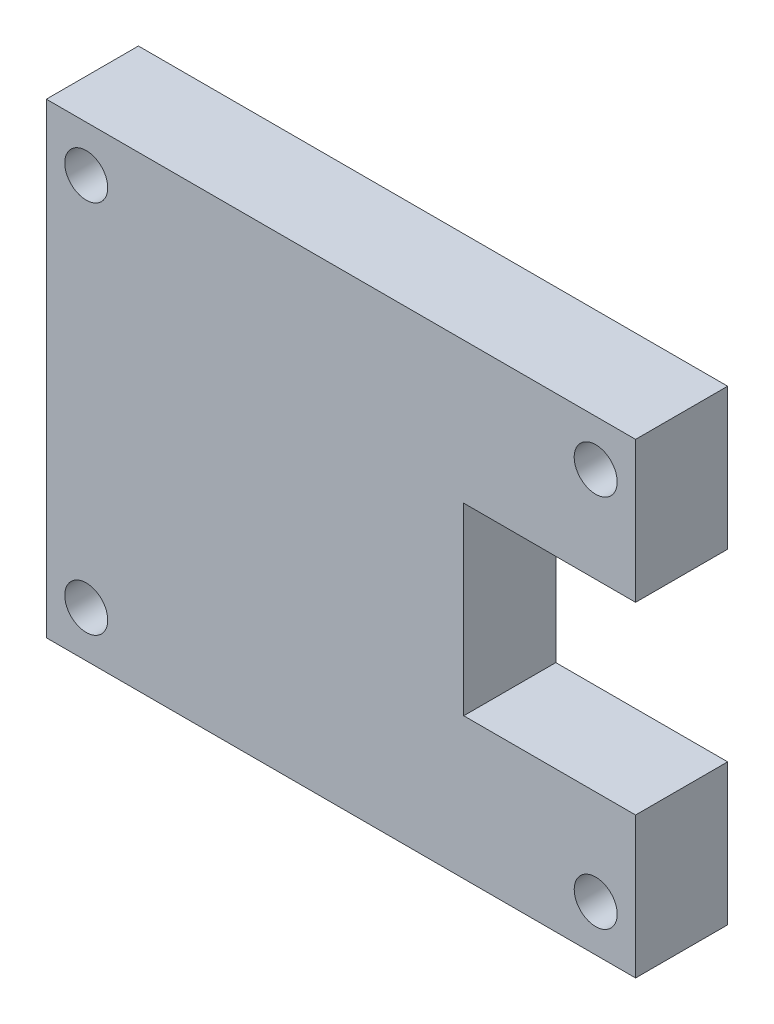
ISO-10303-21;
HEADER;
FILE_DESCRIPTION(('STEP AP214'),'2;1');
FILE_NAME('part.step','',(''),(''),'','','');
FILE_SCHEMA(('AUTOMOTIVE_DESIGN { 1 0 10303 214 1 1 1 1 }'));
ENDSEC;
DATA;
#1=APPLICATION_CONTEXT('core data for automotive mechanical design processes');
#2=APPLICATION_PROTOCOL_DEFINITION('international standard','automotive_design',2000,#1);
#3=PRODUCT_CONTEXT('',#1,'mechanical');
#4=PRODUCT('Part','Part','',(#3));
#5=PRODUCT_RELATED_PRODUCT_CATEGORY('part','',(#4));
#6=PRODUCT_DEFINITION_FORMATION('','',#4);
#7=PRODUCT_DEFINITION_CONTEXT('part definition',#1,'design');
#8=PRODUCT_DEFINITION('design','',#6,#7);
#9=PRODUCT_DEFINITION_SHAPE('','',#8);
#10=(LENGTH_UNIT() NAMED_UNIT(*) SI_UNIT(.MILLI.,.METRE.));
#11=(NAMED_UNIT(*) PLANE_ANGLE_UNIT() SI_UNIT($,.RADIAN.));
#12=(NAMED_UNIT(*) SI_UNIT($,.STERADIAN.) SOLID_ANGLE_UNIT());
#13=UNCERTAINTY_MEASURE_WITH_UNIT(LENGTH_MEASURE(1.E-05),#10,'distance_accuracy_value','');
#14=(GEOMETRIC_REPRESENTATION_CONTEXT(3) GLOBAL_UNCERTAINTY_ASSIGNED_CONTEXT((#13)) GLOBAL_UNIT_ASSIGNED_CONTEXT((#10,
#11,#12)) REPRESENTATION_CONTEXT('',''));
#15=CARTESIAN_POINT('',(0.,0.,0.));
#16=DIRECTION('',(0.,0.,1.));
#17=DIRECTION('',(1.,0.,0.));
#18=AXIS2_PLACEMENT_3D('',#15,#16,#17);
#19=CARTESIAN_POINT('',(24.,-19.,7.5));
#20=DIRECTION('',(-1.,0.,0.));
#21=DIRECTION('',(0.,0.,1.));
#22=AXIS2_PLACEMENT_3D('',#19,#20,#21);
#23=PLANE('',#22);
#24=DIRECTION('',(0.,1.,0.));
#25=VECTOR('',#24,1.);
#26=CARTESIAN_POINT('',(24.,-19.,7.5));
#27=LINE('',#26,#25);
#28=CARTESIAN_POINT('',(24.,7.5,7.5));
#29=VERTEX_POINT('',#28);
#30=CARTESIAN_POINT('',(24.,19.,7.5));
#31=VERTEX_POINT('',#30);
#32=EDGE_CURVE('E85',#29,#31,#27,.T.);
#33=ORIENTED_EDGE('',*,*,#32,.F.);
#34=DIRECTION('',(0.,0.,1.));
#35=VECTOR('',#34,1.);
#36=CARTESIAN_POINT('',(24.,7.5,0.));
#37=LINE('',#36,#35);
#38=CARTESIAN_POINT('',(24.,7.5,0.));
#39=VERTEX_POINT('',#38);
#40=EDGE_CURVE('E140',#39,#29,#37,.T.);
#41=ORIENTED_EDGE('',*,*,#40,.F.);
#42=DIRECTION('',(0.,1.,0.));
#43=VECTOR('',#42,1.);
#44=CARTESIAN_POINT('',(24.,-19.,0.));
#45=LINE('',#44,#43);
#46=CARTESIAN_POINT('',(24.,19.,0.));
#47=VERTEX_POINT('',#46);
#48=EDGE_CURVE('E164',#39,#47,#45,.T.);
#49=ORIENTED_EDGE('',*,*,#48,.T.);
#50=DIRECTION('',(0.,0.,-1.));
#51=VECTOR('',#50,1.);
#52=CARTESIAN_POINT('',(24.,19.,7.5));
#53=LINE('',#52,#51);
#54=EDGE_CURVE('E11',#31,#47,#53,.T.);
#55=ORIENTED_EDGE('',*,*,#54,.F.);
#56=EDGE_LOOP('',(#33,#41,#49,#55));
#57=FACE_BOUND('',#56,.T.);
#58=ADVANCED_FACE('F33',(#57),#23,.F.);
#59=CARTESIAN_POINT('',(24.,-19.,0.));
#60=VERTEX_POINT('',#59);
#61=CARTESIAN_POINT('',(24.,-7.5,0.));
#62=VERTEX_POINT('',#61);
#63=EDGE_CURVE('E175',#60,#62,#45,.T.);
#64=ORIENTED_EDGE('',*,*,#63,.T.);
#65=DIRECTION('',(0.,0.,1.));
#66=VECTOR('',#65,1.);
#67=CARTESIAN_POINT('',(24.,-7.5,0.));
#68=LINE('',#67,#66);
#69=CARTESIAN_POINT('',(24.,-7.5,7.5));
#70=VERTEX_POINT('',#69);
#71=EDGE_CURVE('E48',#62,#70,#68,.T.);
#72=ORIENTED_EDGE('',*,*,#71,.T.);
#73=CARTESIAN_POINT('',(24.,-19.,7.5));
#74=VERTEX_POINT('',#73);
#75=EDGE_CURVE('E167',#74,#70,#27,.T.);
#76=ORIENTED_EDGE('',*,*,#75,.F.);
#77=DIRECTION('',(0.,0.,-1.));
#78=VECTOR('',#77,1.);
#79=CARTESIAN_POINT('',(24.,-19.,7.5));
#80=LINE('',#79,#78);
#81=EDGE_CURVE('E174',#74,#60,#80,.T.);
#82=ORIENTED_EDGE('',*,*,#81,.T.);
#83=EDGE_LOOP('',(#64,#72,#76,#82));
#84=FACE_BOUND('',#83,.T.);
#85=ADVANCED_FACE('F35',(#84),#23,.F.);
#86=CARTESIAN_POINT('',(-24.,19.,7.5));
#87=DIRECTION('',(0.,-1.,0.));
#88=DIRECTION('',(0.,0.,-1.));
#89=AXIS2_PLACEMENT_3D('',#86,#87,#88);
#90=PLANE('',#89);
#91=DIRECTION('',(-1.,0.,0.));
#92=VECTOR('',#91,1.);
#93=CARTESIAN_POINT('',(-24.,19.,0.));
#94=LINE('',#93,#92);
#95=CARTESIAN_POINT('',(-24.,19.,0.));
#96=VERTEX_POINT('',#95);
#97=EDGE_CURVE('E177',#47,#96,#94,.T.);
#98=ORIENTED_EDGE('',*,*,#97,.T.);
#99=DIRECTION('',(0.,0.,-1.));
#100=VECTOR('',#99,1.);
#101=CARTESIAN_POINT('',(-24.,19.,7.5));
#102=LINE('',#101,#100);
#103=CARTESIAN_POINT('',(-24.,19.,7.5));
#104=VERTEX_POINT('',#103);
#105=EDGE_CURVE('E41',#104,#96,#102,.T.);
#106=ORIENTED_EDGE('',*,*,#105,.F.);
#107=DIRECTION('',(-1.,0.,0.));
#108=VECTOR('',#107,1.);
#109=CARTESIAN_POINT('',(-24.,19.,7.5));
#110=LINE('',#109,#108);
#111=EDGE_CURVE('E169',#31,#104,#110,.T.);
#112=ORIENTED_EDGE('',*,*,#111,.F.);
#113=ORIENTED_EDGE('',*,*,#54,.T.);
#114=EDGE_LOOP('',(#98,#106,#112,#113));
#115=FACE_BOUND('',#114,.T.);
#116=ADVANCED_FACE('F206',(#115),#90,.F.);
#117=CARTESIAN_POINT('',(-24.,-19.,7.5));
#118=DIRECTION('',(1.,0.,0.));
#119=DIRECTION('',(0.,0.,-1.));
#120=AXIS2_PLACEMENT_3D('',#117,#118,#119);
#121=PLANE('',#120);
#122=DIRECTION('',(0.,-1.,0.));
#123=VECTOR('',#122,1.);
#124=CARTESIAN_POINT('',(-24.,-19.,0.));
#125=LINE('',#124,#123);
#126=CARTESIAN_POINT('',(-24.,-19.,0.));
#127=VERTEX_POINT('',#126);
#128=EDGE_CURVE('E179',#96,#127,#125,.T.);
#129=ORIENTED_EDGE('',*,*,#128,.T.);
#130=DIRECTION('',(0.,0.,-1.));
#131=VECTOR('',#130,1.);
#132=CARTESIAN_POINT('',(-24.,-19.,7.5));
#133=LINE('',#132,#131);
#134=CARTESIAN_POINT('',(-24.,-19.,7.5));
#135=VERTEX_POINT('',#134);
#136=EDGE_CURVE('E183',#135,#127,#133,.T.);
#137=ORIENTED_EDGE('',*,*,#136,.F.);
#138=DIRECTION('',(0.,-1.,0.));
#139=VECTOR('',#138,1.);
#140=CARTESIAN_POINT('',(-24.,-19.,7.5));
#141=LINE('',#140,#139);
#142=EDGE_CURVE('E171',#104,#135,#141,.T.);
#143=ORIENTED_EDGE('',*,*,#142,.F.);
#144=ORIENTED_EDGE('',*,*,#105,.T.);
#145=EDGE_LOOP('',(#129,#137,#143,#144));
#146=FACE_BOUND('',#145,.T.);
#147=ADVANCED_FACE('F189',(#146),#121,.F.);
#148=CARTESIAN_POINT('',(-24.,-19.,7.5));
#149=DIRECTION('',(0.,1.,0.));
#150=DIRECTION('',(0.,0.,1.));
#151=AXIS2_PLACEMENT_3D('',#148,#149,#150);
#152=PLANE('',#151);
#153=DIRECTION('',(1.,0.,0.));
#154=VECTOR('',#153,1.);
#155=CARTESIAN_POINT('',(-24.,-19.,0.));
#156=LINE('',#155,#154);
#157=EDGE_CURVE('E78',#127,#60,#156,.T.);
#158=ORIENTED_EDGE('',*,*,#157,.T.);
#159=ORIENTED_EDGE('',*,*,#81,.F.);
#160=DIRECTION('',(1.,0.,0.));
#161=VECTOR('',#160,1.);
#162=CARTESIAN_POINT('',(-24.,-19.,7.5));
#163=LINE('',#162,#161);
#164=EDGE_CURVE('E57',#135,#74,#163,.T.);
#165=ORIENTED_EDGE('',*,*,#164,.F.);
#166=ORIENTED_EDGE('',*,*,#136,.T.);
#167=EDGE_LOOP('',(#158,#159,#165,#166));
#168=FACE_BOUND('',#167,.T.);
#169=ADVANCED_FACE('F195',(#168),#152,.F.);
#170=CARTESIAN_POINT('',(0.,0.,7.5));
#171=DIRECTION('',(0.,0.,-1.));
#172=DIRECTION('',(-1.,0.,0.));
#173=AXIS2_PLACEMENT_3D('',#170,#171,#172);
#174=PLANE('',#173);
#175=CARTESIAN_POINT('',(-20.75,15.25,7.5));
#176=DIRECTION('',(0.,0.,1.));
#177=DIRECTION('',(-1.,0.,0.));
#178=AXIS2_PLACEMENT_3D('',#175,#176,#177);
#179=CIRCLE('',#178,1.75);
#180=CARTESIAN_POINT('',(-22.5,15.25,7.5));
#181=VERTEX_POINT('',#180);
#182=EDGE_CURVE('E153',#181,#181,#179,.T.);
#183=ORIENTED_EDGE('',*,*,#182,.F.);
#184=EDGE_LOOP('',(#183));
#185=FACE_BOUND('',#184,.T.);
#186=CARTESIAN_POINT('',(20.75,-15.25,7.5));
#187=DIRECTION('',(0.,0.,1.));
#188=DIRECTION('',(-1.,0.,0.));
#189=AXIS2_PLACEMENT_3D('',#186,#187,#188);
#190=CIRCLE('',#189,1.75);
#191=CARTESIAN_POINT('',(19.,-15.25,7.5));
#192=VERTEX_POINT('',#191);
#193=EDGE_CURVE('E146',#192,#192,#190,.T.);
#194=ORIENTED_EDGE('',*,*,#193,.F.);
#195=EDGE_LOOP('',(#194));
#196=FACE_BOUND('',#195,.T.);
#197=CARTESIAN_POINT('',(-20.75,-15.25,7.5));
#198=DIRECTION('',(0.,0.,1.));
#199=DIRECTION('',(1.,0.,0.));
#200=AXIS2_PLACEMENT_3D('',#197,#198,#199);
#201=CIRCLE('',#200,1.75);
#202=CARTESIAN_POINT('',(-19.,-15.25,7.5));
#203=VERTEX_POINT('',#202);
#204=EDGE_CURVE('E139',#203,#203,#201,.T.);
#205=ORIENTED_EDGE('',*,*,#204,.F.);
#206=EDGE_LOOP('',(#205));
#207=FACE_BOUND('',#206,.T.);
#208=CARTESIAN_POINT('',(20.75,15.25,7.5));
#209=DIRECTION('',(0.,0.,1.));
#210=DIRECTION('',(1.,0.,0.));
#211=AXIS2_PLACEMENT_3D('',#208,#209,#210);
#212=CIRCLE('',#211,1.75);
#213=CARTESIAN_POINT('',(22.5,15.25,7.5));
#214=VERTEX_POINT('',#213);
#215=EDGE_CURVE('E152',#214,#214,#212,.T.);
#216=ORIENTED_EDGE('',*,*,#215,.F.);
#217=EDGE_LOOP('',(#216));
#218=FACE_BOUND('',#217,.T.);
#219=DIRECTION('',(0.,-1.,0.));
#220=VECTOR('',#219,1.);
#221=CARTESIAN_POINT('',(10.,0.,7.5));
#222=LINE('',#221,#220);
#223=CARTESIAN_POINT('',(10.,7.5,7.5));
#224=VERTEX_POINT('',#223);
#225=CARTESIAN_POINT('',(10.,-7.5,7.5));
#226=VERTEX_POINT('',#225);
#227=EDGE_CURVE('E115',#224,#226,#222,.T.);
#228=ORIENTED_EDGE('',*,*,#227,.F.);
#229=DIRECTION('',(-1.,0.,0.));
#230=VECTOR('',#229,1.);
#231=CARTESIAN_POINT('',(0.,7.5,7.5));
#232=LINE('',#231,#230);
#233=EDGE_CURVE('E128',#29,#224,#232,.T.);
#234=ORIENTED_EDGE('',*,*,#233,.F.);
#235=ORIENTED_EDGE('',*,*,#32,.T.);
#236=ORIENTED_EDGE('',*,*,#111,.T.);
#237=ORIENTED_EDGE('',*,*,#142,.T.);
#238=ORIENTED_EDGE('',*,*,#164,.T.);
#239=ORIENTED_EDGE('',*,*,#75,.T.);
#240=DIRECTION('',(1.,0.,0.));
#241=VECTOR('',#240,1.);
#242=CARTESIAN_POINT('',(0.,-7.5,7.5));
#243=LINE('',#242,#241);
#244=EDGE_CURVE('E131',#226,#70,#243,.T.);
#245=ORIENTED_EDGE('',*,*,#244,.F.);
#246=EDGE_LOOP('',(#228,#234,#235,#236,#237,#238,#239,#245));
#247=FACE_BOUND('',#246,.T.);
#248=ADVANCED_FACE('F197',(#185,#196,#207,#218,#247),#174,.F.);
#249=CARTESIAN_POINT('',(0.,0.,0.));
#250=DIRECTION('',(0.,0.,-1.));
#251=DIRECTION('',(-1.,0.,0.));
#252=AXIS2_PLACEMENT_3D('',#249,#250,#251);
#253=PLANE('',#252);
#254=DIRECTION('',(-1.,0.,0.));
#255=VECTOR('',#254,1.);
#256=CARTESIAN_POINT('',(0.,7.5,0.));
#257=LINE('',#256,#255);
#258=CARTESIAN_POINT('',(10.,7.5,0.));
#259=VERTEX_POINT('',#258);
#260=EDGE_CURVE('E117',#39,#259,#257,.T.);
#261=ORIENTED_EDGE('',*,*,#260,.T.);
#262=DIRECTION('',(0.,-1.,0.));
#263=VECTOR('',#262,1.);
#264=CARTESIAN_POINT('',(10.,0.,0.));
#265=LINE('',#264,#263);
#266=CARTESIAN_POINT('',(10.,-7.5,0.));
#267=VERTEX_POINT('',#266);
#268=EDGE_CURVE('E112',#259,#267,#265,.T.);
#269=ORIENTED_EDGE('',*,*,#268,.T.);
#270=DIRECTION('',(1.,0.,0.));
#271=VECTOR('',#270,1.);
#272=CARTESIAN_POINT('',(0.,-7.5,0.));
#273=LINE('',#272,#271);
#274=EDGE_CURVE('E119',#267,#62,#273,.T.);
#275=ORIENTED_EDGE('',*,*,#274,.T.);
#276=ORIENTED_EDGE('',*,*,#63,.F.);
#277=ORIENTED_EDGE('',*,*,#157,.F.);
#278=ORIENTED_EDGE('',*,*,#128,.F.);
#279=ORIENTED_EDGE('',*,*,#97,.F.);
#280=ORIENTED_EDGE('',*,*,#48,.F.);
#281=EDGE_LOOP('',(#261,#269,#275,#276,#277,#278,#279,#280));
#282=FACE_BOUND('',#281,.T.);
#283=CARTESIAN_POINT('',(-20.75,15.25,0.));
#284=DIRECTION('',(0.,0.,1.));
#285=DIRECTION('',(-1.,0.,0.));
#286=AXIS2_PLACEMENT_3D('',#283,#284,#285);
#287=CIRCLE('',#286,1.75);
#288=CARTESIAN_POINT('',(-22.5,15.25,0.));
#289=VERTEX_POINT('',#288);
#290=EDGE_CURVE('E149',#289,#289,#287,.T.);
#291=ORIENTED_EDGE('',*,*,#290,.T.);
#292=EDGE_LOOP('',(#291));
#293=FACE_BOUND('',#292,.T.);
#294=CARTESIAN_POINT('',(20.75,-15.25,0.));
#295=DIRECTION('',(0.,0.,1.));
#296=DIRECTION('',(-1.,0.,0.));
#297=AXIS2_PLACEMENT_3D('',#294,#295,#296);
#298=CIRCLE('',#297,1.75);
#299=CARTESIAN_POINT('',(19.,-15.25,0.));
#300=VERTEX_POINT('',#299);
#301=EDGE_CURVE('E156',#300,#300,#298,.T.);
#302=ORIENTED_EDGE('',*,*,#301,.T.);
#303=EDGE_LOOP('',(#302));
#304=FACE_BOUND('',#303,.T.);
#305=CARTESIAN_POINT('',(-20.75,-15.25,0.));
#306=DIRECTION('',(0.,0.,1.));
#307=DIRECTION('',(1.,0.,0.));
#308=AXIS2_PLACEMENT_3D('',#305,#306,#307);
#309=CIRCLE('',#308,1.75);
#310=CARTESIAN_POINT('',(-19.,-15.25,0.));
#311=VERTEX_POINT('',#310);
#312=EDGE_CURVE('E143',#311,#311,#309,.T.);
#313=ORIENTED_EDGE('',*,*,#312,.T.);
#314=EDGE_LOOP('',(#313));
#315=FACE_BOUND('',#314,.T.);
#316=CARTESIAN_POINT('',(20.75,15.25,0.));
#317=DIRECTION('',(0.,0.,1.));
#318=DIRECTION('',(1.,0.,0.));
#319=AXIS2_PLACEMENT_3D('',#316,#317,#318);
#320=CIRCLE('',#319,1.75);
#321=CARTESIAN_POINT('',(22.5,15.25,0.));
#322=VERTEX_POINT('',#321);
#323=EDGE_CURVE('E161',#322,#322,#320,.T.);
#324=ORIENTED_EDGE('',*,*,#323,.T.);
#325=EDGE_LOOP('',(#324));
#326=FACE_BOUND('',#325,.T.);
#327=ADVANCED_FACE('F125',(#282,#293,#304,#315,#326),#253,.T.);
#328=CARTESIAN_POINT('',(20.75,15.25,0.));
#329=DIRECTION('',(0.,0.,1.));
#330=DIRECTION('',(1.,0.,0.));
#331=AXIS2_PLACEMENT_3D('',#328,#329,#330);
#332=CYLINDRICAL_SURFACE('',#331,1.75);
#333=ORIENTED_EDGE('',*,*,#323,.F.);
#334=EDGE_LOOP('',(#333));
#335=FACE_BOUND('',#334,.T.);
#336=ORIENTED_EDGE('',*,*,#215,.T.);
#337=EDGE_LOOP('',(#336));
#338=FACE_BOUND('',#337,.T.);
#339=ADVANCED_FACE('F233',(#335,#338),#332,.F.);
#340=CARTESIAN_POINT('',(-20.75,-15.25,0.));
#341=DIRECTION('',(0.,0.,1.));
#342=DIRECTION('',(1.,0.,0.));
#343=AXIS2_PLACEMENT_3D('',#340,#341,#342);
#344=CYLINDRICAL_SURFACE('',#343,1.75);
#345=ORIENTED_EDGE('',*,*,#312,.F.);
#346=EDGE_LOOP('',(#345));
#347=FACE_BOUND('',#346,.T.);
#348=ORIENTED_EDGE('',*,*,#204,.T.);
#349=EDGE_LOOP('',(#348));
#350=FACE_BOUND('',#349,.T.);
#351=ADVANCED_FACE('F229',(#347,#350),#344,.F.);
#352=CARTESIAN_POINT('',(20.75,-15.25,0.));
#353=DIRECTION('',(0.,0.,1.));
#354=DIRECTION('',(1.,0.,0.));
#355=AXIS2_PLACEMENT_3D('',#352,#353,#354);
#356=CYLINDRICAL_SURFACE('',#355,1.75);
#357=ORIENTED_EDGE('',*,*,#301,.F.);
#358=EDGE_LOOP('',(#357));
#359=FACE_BOUND('',#358,.T.);
#360=ORIENTED_EDGE('',*,*,#193,.T.);
#361=EDGE_LOOP('',(#360));
#362=FACE_BOUND('',#361,.T.);
#363=ADVANCED_FACE('F232',(#359,#362),#356,.F.);
#364=CARTESIAN_POINT('',(-20.75,15.25,0.));
#365=DIRECTION('',(0.,0.,1.));
#366=DIRECTION('',(1.,0.,0.));
#367=AXIS2_PLACEMENT_3D('',#364,#365,#366);
#368=CYLINDRICAL_SURFACE('',#367,1.75);
#369=ORIENTED_EDGE('',*,*,#290,.F.);
#370=EDGE_LOOP('',(#369));
#371=FACE_BOUND('',#370,.T.);
#372=ORIENTED_EDGE('',*,*,#182,.T.);
#373=EDGE_LOOP('',(#372));
#374=FACE_BOUND('',#373,.T.);
#375=ADVANCED_FACE('F226',(#371,#374),#368,.F.);
#376=CARTESIAN_POINT('',(10.,0.,0.));
#377=DIRECTION('',(-1.,0.,0.));
#378=DIRECTION('',(0.,0.,1.));
#379=AXIS2_PLACEMENT_3D('',#376,#377,#378);
#380=PLANE('',#379);
#381=ORIENTED_EDGE('',*,*,#227,.T.);
#382=DIRECTION('',(0.,0.,1.));
#383=VECTOR('',#382,1.);
#384=CARTESIAN_POINT('',(10.,-7.5,0.));
#385=LINE('',#384,#383);
#386=EDGE_CURVE('E109',#267,#226,#385,.T.);
#387=ORIENTED_EDGE('',*,*,#386,.F.);
#388=ORIENTED_EDGE('',*,*,#268,.F.);
#389=DIRECTION('',(0.,0.,1.));
#390=VECTOR('',#389,1.);
#391=CARTESIAN_POINT('',(10.,7.5,0.));
#392=LINE('',#391,#390);
#393=EDGE_CURVE('E137',#259,#224,#392,.T.);
#394=ORIENTED_EDGE('',*,*,#393,.T.);
#395=EDGE_LOOP('',(#381,#387,#388,#394));
#396=FACE_BOUND('',#395,.T.);
#397=ADVANCED_FACE('F110',(#396),#380,.F.);
#398=CARTESIAN_POINT('',(0.,7.5,0.));
#399=DIRECTION('',(0.,1.,0.));
#400=DIRECTION('',(0.,0.,1.));
#401=AXIS2_PLACEMENT_3D('',#398,#399,#400);
#402=PLANE('',#401);
#403=ORIENTED_EDGE('',*,*,#233,.T.);
#404=ORIENTED_EDGE('',*,*,#393,.F.);
#405=ORIENTED_EDGE('',*,*,#260,.F.);
#406=ORIENTED_EDGE('',*,*,#40,.T.);
#407=EDGE_LOOP('',(#403,#404,#405,#406));
#408=FACE_BOUND('',#407,.T.);
#409=ADVANCED_FACE('F218',(#408),#402,.F.);
#410=CARTESIAN_POINT('',(0.,-7.5,0.));
#411=DIRECTION('',(0.,-1.,0.));
#412=DIRECTION('',(1.,0.,0.));
#413=AXIS2_PLACEMENT_3D('',#410,#411,#412);
#414=PLANE('',#413);
#415=ORIENTED_EDGE('',*,*,#244,.T.);
#416=ORIENTED_EDGE('',*,*,#71,.F.);
#417=ORIENTED_EDGE('',*,*,#274,.F.);
#418=ORIENTED_EDGE('',*,*,#386,.T.);
#419=EDGE_LOOP('',(#415,#416,#417,#418));
#420=FACE_BOUND('',#419,.T.);
#421=ADVANCED_FACE('F120',(#420),#414,.F.);
#422=CLOSED_SHELL('',(#58,#85,#116,#147,#169,#248,#327,#339,#351,#363,#375,#397,#409,#421));
#423=MANIFOLD_SOLID_BREP('B2',#422);
#424=ADVANCED_BREP_SHAPE_REPRESENTATION('',(#18,#423),#14);
#425=SHAPE_DEFINITION_REPRESENTATION(#9,#424);
ENDSEC;
END-ISO-10303-21;
